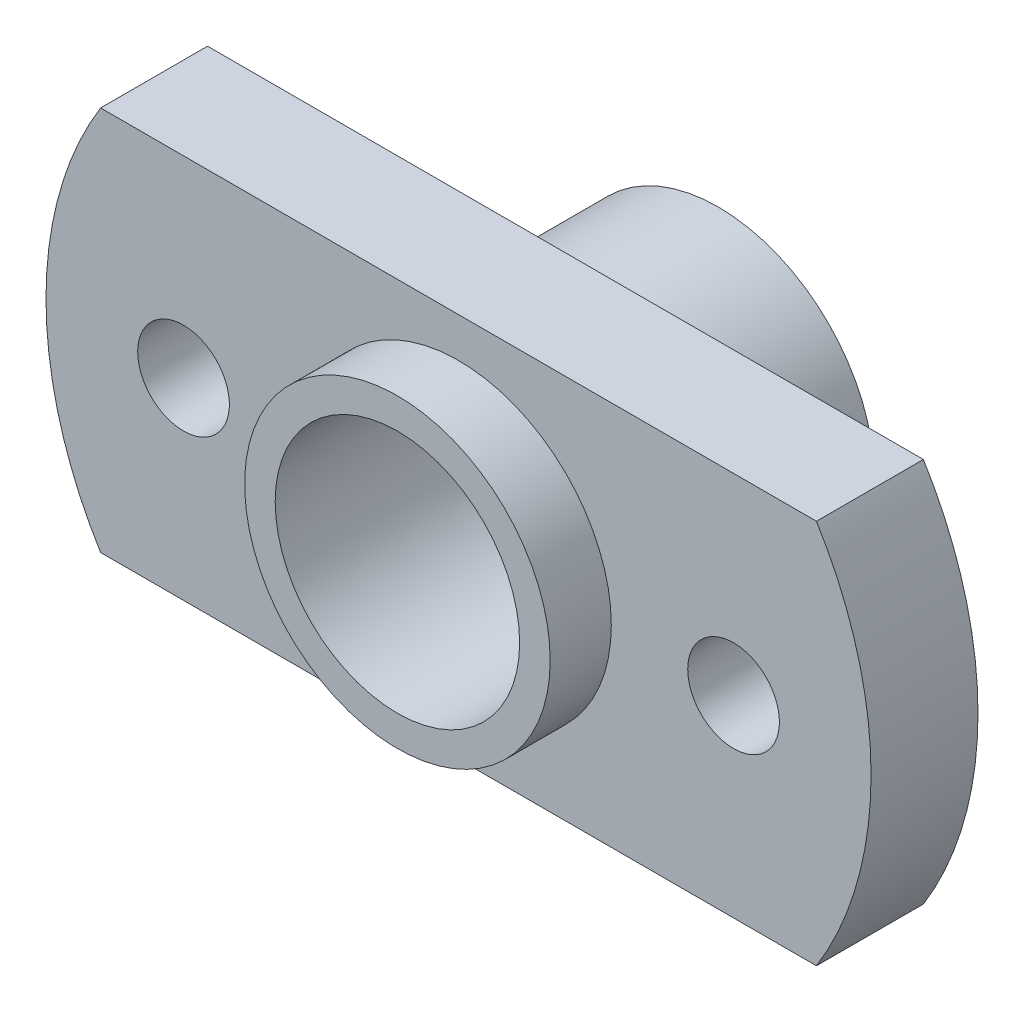
ISO-10303-21;
HEADER;
FILE_DESCRIPTION(('STEP AP214'),'2;1');
FILE_NAME('part.step','',(''),(''),'','','');
FILE_SCHEMA(('AUTOMOTIVE_DESIGN { 1 0 10303 214 1 1 1 1 }'));
ENDSEC;
DATA;
#1=APPLICATION_CONTEXT('core data for automotive mechanical design processes');
#2=APPLICATION_PROTOCOL_DEFINITION('international standard','automotive_design',2000,#1);
#3=PRODUCT_CONTEXT('',#1,'mechanical');
#4=PRODUCT('Part','Part','',(#3));
#5=PRODUCT_RELATED_PRODUCT_CATEGORY('part','',(#4));
#6=PRODUCT_DEFINITION_FORMATION('','',#4);
#7=PRODUCT_DEFINITION_CONTEXT('part definition',#1,'design');
#8=PRODUCT_DEFINITION('design','',#6,#7);
#9=PRODUCT_DEFINITION_SHAPE('','',#8);
#10=(LENGTH_UNIT() NAMED_UNIT(*) SI_UNIT(.MILLI.,.METRE.));
#11=(NAMED_UNIT(*) PLANE_ANGLE_UNIT() SI_UNIT($,.RADIAN.));
#12=(NAMED_UNIT(*) SI_UNIT($,.STERADIAN.) SOLID_ANGLE_UNIT());
#13=UNCERTAINTY_MEASURE_WITH_UNIT(LENGTH_MEASURE(1.E-05),#10,'distance_accuracy_value','');
#14=(GEOMETRIC_REPRESENTATION_CONTEXT(3) GLOBAL_UNCERTAINTY_ASSIGNED_CONTEXT((#13)) GLOBAL_UNIT_ASSIGNED_CONTEXT((#10,
#11,#12)) REPRESENTATION_CONTEXT('',''));
#15=CARTESIAN_POINT('',(0.,0.,0.));
#16=DIRECTION('',(0.,0.,1.));
#17=DIRECTION('',(1.,0.,0.));
#18=AXIS2_PLACEMENT_3D('',#15,#16,#17);
#19=CARTESIAN_POINT('',(-166.1,-80.50005788601,172.0264319846));
#20=DIRECTION('',(0.,0.,1.));
#21=DIRECTION('',(1.,0.,0.));
#22=AXIS2_PLACEMENT_3D('',#19,#20,#21);
#23=PLANE('',#22);
#24=CARTESIAN_POINT('',(-166.1,-80.50005788601,172.0264319846));
#25=DIRECTION('',(0.,0.,-1.));
#26=DIRECTION('',(-1.,0.,0.));
#27=AXIS2_PLACEMENT_3D('',#24,#25,#26);
#28=CIRCLE('',#27,4.);
#29=CARTESIAN_POINT('',(-170.1,-80.50005788601,172.0264319846));
#30=VERTEX_POINT('',#29);
#31=EDGE_CURVE('E111',#30,#30,#28,.F.);
#32=ORIENTED_EDGE('',*,*,#31,.T.);
#33=EDGE_LOOP('',(#32));
#34=FACE_BOUND('',#33,.T.);
#35=CARTESIAN_POINT('',(-166.1,-80.50005788601,172.0264319846));
#36=DIRECTION('',(0.,0.,-1.));
#37=DIRECTION('',(-1.,0.,0.));
#38=AXIS2_PLACEMENT_3D('',#35,#36,#37);
#39=CIRCLE('',#38,5.09999999999999);
#40=CARTESIAN_POINT('',(-171.2,-80.50005788601,172.0264319846));
#41=VERTEX_POINT('',#40);
#42=EDGE_CURVE('E19',#41,#41,#39,.F.);
#43=ORIENTED_EDGE('',*,*,#42,.F.);
#44=EDGE_LOOP('',(#43));
#45=FACE_BOUND('',#44,.T.);
#46=ADVANCED_FACE('F16',(#34,#45),#23,.F.);
#47=CARTESIAN_POINT('',(-166.1,-80.50005788601,182.5264319846));
#48=DIRECTION('',(0.,0.,-1.));
#49=DIRECTION('',(-1.,0.,0.));
#50=AXIS2_PLACEMENT_3D('',#47,#48,#49);
#51=CYLINDRICAL_SURFACE('',#50,5.09999999999999);
#52=ORIENTED_EDGE('',*,*,#42,.T.);
#53=EDGE_LOOP('',(#52));
#54=FACE_BOUND('',#53,.T.);
#55=CARTESIAN_POINT('',(-166.1,-80.50005788601,177.0264319846));
#56=DIRECTION('',(0.,0.,-1.));
#57=DIRECTION('',(-1.,0.,0.));
#58=AXIS2_PLACEMENT_3D('',#55,#56,#57);
#59=CIRCLE('',#58,5.09999999999999);
#60=CARTESIAN_POINT('',(-171.2,-80.50005788601,177.0264319846));
#61=VERTEX_POINT('',#60);
#62=EDGE_CURVE('E109',#61,#61,#59,.T.);
#63=ORIENTED_EDGE('',*,*,#62,.T.);
#64=EDGE_LOOP('',(#63));
#65=FACE_BOUND('',#64,.T.);
#66=ADVANCED_FACE('F118',(#54,#65),#51,.T.);
#67=CARTESIAN_POINT('',(-166.1,-80.50005788601,182.5264319846));
#68=DIRECTION('',(0.,0.,-1.));
#69=DIRECTION('',(-1.,0.,0.));
#70=AXIS2_PLACEMENT_3D('',#67,#68,#69);
#71=CYLINDRICAL_SURFACE('',#70,4.);
#72=CARTESIAN_POINT('',(-166.1,-80.50005788601,182.5264319846));
#73=DIRECTION('',(0.,0.,-1.));
#74=DIRECTION('',(-1.,0.,0.));
#75=AXIS2_PLACEMENT_3D('',#72,#73,#74);
#76=CIRCLE('',#75,4.);
#77=CARTESIAN_POINT('',(-170.1,-80.50005788601,182.5264319846));
#78=VERTEX_POINT('',#77);
#79=EDGE_CURVE('E106',#78,#78,#76,.T.);
#80=ORIENTED_EDGE('',*,*,#79,.F.);
#81=EDGE_LOOP('',(#80));
#82=FACE_BOUND('',#81,.T.);
#83=ORIENTED_EDGE('',*,*,#31,.F.);
#84=EDGE_LOOP('',(#83));
#85=FACE_BOUND('',#84,.T.);
#86=ADVANCED_FACE('F126',(#82,#85),#71,.F.);
#87=CARTESIAN_POINT('',(-166.1,-80.50005788601,177.0264319846));
#88=DIRECTION('',(0.,0.,1.));
#89=DIRECTION('',(1.,0.,0.));
#90=AXIS2_PLACEMENT_3D('',#87,#88,#89);
#91=PLANE('',#90);
#92=ORIENTED_EDGE('',*,*,#62,.F.);
#93=EDGE_LOOP('',(#92));
#94=FACE_BOUND('',#93,.T.);
#95=DIRECTION('',(1.,0.,0.));
#96=VECTOR('',#95,1.);
#97=CARTESIAN_POINT('',(-155.8528172695,-74.20005788601,177.0264319846));
#98=LINE('',#97,#96);
#99=CARTESIAN_POINT('',(-177.813226718326,-74.20005788601,177.0264319846));
#100=VERTEX_POINT('',#99);
#101=CARTESIAN_POINT('',(-154.386773281667,-74.20005788601,177.0264319846));
#102=VERTEX_POINT('',#101);
#103=EDGE_CURVE('E60',#100,#102,#98,.T.);
#104=ORIENTED_EDGE('',*,*,#103,.T.);
#105=CARTESIAN_POINT('',(-164.6,-80.50005788601,177.0264319846));
#106=DIRECTION('',(0.,0.,1.));
#107=DIRECTION('',(1.,0.,0.));
#108=AXIS2_PLACEMENT_3D('',#105,#106,#107);
#109=CIRCLE('',#108,12.);
#110=CARTESIAN_POINT('',(-154.386773281659,-86.8000578859906,177.0264319846));
#111=VERTEX_POINT('',#110);
#112=EDGE_CURVE('E80',#111,#102,#109,.T.);
#113=ORIENTED_EDGE('',*,*,#112,.F.);
#114=DIRECTION('',(1.,0.,0.));
#115=VECTOR('',#114,1.);
#116=CARTESIAN_POINT('',(-177.6681148043,-86.80005788601,177.0264319846));
#117=LINE('',#116,#115);
#118=CARTESIAN_POINT('',(-177.813226718329,-86.80005788601,177.0264319846));
#119=VERTEX_POINT('',#118);
#120=EDGE_CURVE('E63',#111,#119,#117,.F.);
#121=ORIENTED_EDGE('',*,*,#120,.T.);
#122=CARTESIAN_POINT('',(-167.6,-80.50005788601,177.0264319846));
#123=DIRECTION('',(0.,0.,1.));
#124=DIRECTION('',(1.,0.,0.));
#125=AXIS2_PLACEMENT_3D('',#122,#123,#124);
#126=CIRCLE('',#125,12.);
#127=EDGE_CURVE('E55',#100,#119,#126,.T.);
#128=ORIENTED_EDGE('',*,*,#127,.F.);
#129=EDGE_LOOP('',(#104,#113,#121,#128));
#130=FACE_BOUND('',#129,.T.);
#131=CARTESIAN_POINT('',(-175.1,-80.50005788601,177.0264319846));
#132=DIRECTION('',(0.,0.,-1.));
#133=DIRECTION('',(-1.,0.,0.));
#134=AXIS2_PLACEMENT_3D('',#131,#132,#133);
#135=CIRCLE('',#134,1.5);
#136=CARTESIAN_POINT('',(-176.6,-80.50005788601,177.0264319846));
#137=VERTEX_POINT('',#136);
#138=EDGE_CURVE('E66',#137,#137,#135,.F.);
#139=ORIENTED_EDGE('',*,*,#138,.T.);
#140=EDGE_LOOP('',(#139));
#141=FACE_BOUND('',#140,.T.);
#142=CARTESIAN_POINT('',(-157.1,-80.50005788601,177.0264319846));
#143=DIRECTION('',(0.,0.,-1.));
#144=DIRECTION('',(-1.,0.,0.));
#145=AXIS2_PLACEMENT_3D('',#142,#143,#144);
#146=CIRCLE('',#145,1.5);
#147=CARTESIAN_POINT('',(-158.6,-80.50005788601,177.0264319846));
#148=VERTEX_POINT('',#147);
#149=EDGE_CURVE('E103',#148,#148,#146,.F.);
#150=ORIENTED_EDGE('',*,*,#149,.T.);
#151=EDGE_LOOP('',(#150));
#152=FACE_BOUND('',#151,.T.);
#153=ADVANCED_FACE('F57',(#94,#130,#141,#152),#91,.F.);
#154=CARTESIAN_POINT('',(533.2347338397,-344.6602275476,182.5264319846));
#155=DIRECTION('',(0.,0.,1.));
#156=DIRECTION('',(1.,0.,0.));
#157=AXIS2_PLACEMENT_3D('',#154,#155,#156);
#158=PLANE('',#157);
#159=ORIENTED_EDGE('',*,*,#79,.T.);
#160=EDGE_LOOP('',(#159));
#161=FACE_BOUND('',#160,.T.);
#162=CARTESIAN_POINT('',(-166.1,-80.50005788601,182.5264319846));
#163=DIRECTION('',(0.,0.,1.));
#164=DIRECTION('',(1.,0.,0.));
#165=AXIS2_PLACEMENT_3D('',#162,#163,#164);
#166=CIRCLE('',#165,5.);
#167=CARTESIAN_POINT('',(-161.1,-80.50005788601,182.5264319846));
#168=VERTEX_POINT('',#167);
#169=EDGE_CURVE('E75',#168,#168,#166,.F.);
#170=ORIENTED_EDGE('',*,*,#169,.F.);
#171=EDGE_LOOP('',(#170));
#172=FACE_BOUND('',#171,.T.);
#173=ADVANCED_FACE('F157',(#161,#172),#158,.T.);
#174=CARTESIAN_POINT('',(-157.1,-80.50005788601,180.5264319846));
#175=DIRECTION('',(0.,0.,-1.));
#176=DIRECTION('',(-1.,0.,0.));
#177=AXIS2_PLACEMENT_3D('',#174,#175,#176);
#178=CYLINDRICAL_SURFACE('',#177,1.5);
#179=ORIENTED_EDGE('',*,*,#149,.F.);
#180=EDGE_LOOP('',(#179));
#181=FACE_BOUND('',#180,.T.);
#182=CARTESIAN_POINT('',(-157.1,-80.50005788601,180.5264319846));
#183=DIRECTION('',(0.,0.,-1.));
#184=DIRECTION('',(-1.,0.,0.));
#185=AXIS2_PLACEMENT_3D('',#182,#183,#184);
#186=CIRCLE('',#185,1.5);
#187=CARTESIAN_POINT('',(-158.6,-80.50005788601,180.5264319846));
#188=VERTEX_POINT('',#187);
#189=EDGE_CURVE('E96',#188,#188,#186,.T.);
#190=ORIENTED_EDGE('',*,*,#189,.F.);
#191=EDGE_LOOP('',(#190));
#192=FACE_BOUND('',#191,.T.);
#193=ADVANCED_FACE('F153',(#181,#192),#178,.F.);
#194=CARTESIAN_POINT('',(-175.1,-80.50005788601,180.5264319846));
#195=DIRECTION('',(0.,0.,-1.));
#196=DIRECTION('',(-1.,0.,0.));
#197=AXIS2_PLACEMENT_3D('',#194,#195,#196);
#198=CYLINDRICAL_SURFACE('',#197,1.5);
#199=ORIENTED_EDGE('',*,*,#138,.F.);
#200=EDGE_LOOP('',(#199));
#201=FACE_BOUND('',#200,.T.);
#202=CARTESIAN_POINT('',(-175.1,-80.50005788601,180.5264319846));
#203=DIRECTION('',(0.,0.,-1.));
#204=DIRECTION('',(-1.,0.,0.));
#205=AXIS2_PLACEMENT_3D('',#202,#203,#204);
#206=CIRCLE('',#205,1.5);
#207=CARTESIAN_POINT('',(-176.6,-80.50005788601,180.5264319846));
#208=VERTEX_POINT('',#207);
#209=EDGE_CURVE('E93',#208,#208,#206,.T.);
#210=ORIENTED_EDGE('',*,*,#209,.F.);
#211=EDGE_LOOP('',(#210));
#212=FACE_BOUND('',#211,.T.);
#213=ADVANCED_FACE('F150',(#201,#212),#198,.F.);
#214=CARTESIAN_POINT('',(-167.6,-80.50005788601,180.5264319846));
#215=DIRECTION('',(0.,0.,1.));
#216=DIRECTION('',(1.,0.,0.));
#217=AXIS2_PLACEMENT_3D('',#214,#215,#216);
#218=CYLINDRICAL_SURFACE('',#217,12.);
#219=DIRECTION('',(0.,0.,-1.));
#220=VECTOR('',#219,1.);
#221=CARTESIAN_POINT('',(-177.813226718323,-74.20005788601,177.0264319846));
#222=LINE('',#221,#220);
#223=CARTESIAN_POINT('',(-177.813226718328,-74.200057886013,180.5264319846));
#224=VERTEX_POINT('',#223);
#225=EDGE_CURVE('E69',#224,#100,#222,.T.);
#226=ORIENTED_EDGE('',*,*,#225,.T.);
#227=ORIENTED_EDGE('',*,*,#127,.T.);
#228=DIRECTION('',(0.,0.,1.));
#229=VECTOR('',#228,1.);
#230=CARTESIAN_POINT('',(-177.813226718329,-86.80005788601,177.0264319846));
#231=LINE('',#230,#229);
#232=CARTESIAN_POINT('',(-177.813226718329,-86.80005788601,180.5264319846));
#233=VERTEX_POINT('',#232);
#234=EDGE_CURVE('E87',#119,#233,#231,.T.);
#235=ORIENTED_EDGE('',*,*,#234,.T.);
#236=CARTESIAN_POINT('',(-167.6,-80.50005788601,180.5264319846));
#237=DIRECTION('',(0.,0.,1.));
#238=DIRECTION('',(1.,0.,0.));
#239=AXIS2_PLACEMENT_3D('',#236,#237,#238);
#240=CIRCLE('',#239,12.);
#241=EDGE_CURVE('E72',#224,#233,#240,.T.);
#242=ORIENTED_EDGE('',*,*,#241,.F.);
#243=EDGE_LOOP('',(#226,#227,#235,#242));
#244=FACE_BOUND('',#243,.T.);
#245=ADVANCED_FACE('F70',(#244),#218,.T.);
#246=CARTESIAN_POINT('',(-177.6681148043,-86.80005788601,177.0264319846));
#247=DIRECTION('',(0.,1.,0.));
#248=DIRECTION('',(0.,0.,1.));
#249=AXIS2_PLACEMENT_3D('',#246,#247,#248);
#250=PLANE('',#249);
#251=ORIENTED_EDGE('',*,*,#120,.F.);
#252=DIRECTION('',(0.,0.,1.));
#253=VECTOR('',#252,1.);
#254=CARTESIAN_POINT('',(-154.386773281647,-86.8000578859713,180.5264319846));
#255=LINE('',#254,#253);
#256=CARTESIAN_POINT('',(-154.386773281659,-86.8000578859906,180.5264319846));
#257=VERTEX_POINT('',#256);
#258=EDGE_CURVE('E83',#257,#111,#255,.F.);
#259=ORIENTED_EDGE('',*,*,#258,.F.);
#260=DIRECTION('',(1.,0.,0.));
#261=VECTOR('',#260,1.);
#262=CARTESIAN_POINT('',(-166.1,-86.80005788601,180.5264319846));
#263=LINE('',#262,#261);
#264=EDGE_CURVE('E91',#233,#257,#263,.T.);
#265=ORIENTED_EDGE('',*,*,#264,.F.);
#266=ORIENTED_EDGE('',*,*,#234,.F.);
#267=EDGE_LOOP('',(#251,#259,#265,#266));
#268=FACE_BOUND('',#267,.T.);
#269=ADVANCED_FACE('F143',(#268),#250,.F.);
#270=CARTESIAN_POINT('',(-164.6,-80.50005788601,180.5264319846));
#271=DIRECTION('',(0.,0.,1.));
#272=DIRECTION('',(1.,0.,0.));
#273=AXIS2_PLACEMENT_3D('',#270,#271,#272);
#274=CYLINDRICAL_SURFACE('',#273,12.);
#275=DIRECTION('',(0.,0.,-1.));
#276=VECTOR('',#275,1.);
#277=CARTESIAN_POINT('',(-154.386773281663,-74.20005788601,177.0264319846));
#278=LINE('',#277,#276);
#279=CARTESIAN_POINT('',(-154.386773281665,-74.200057886013,180.5264319846));
#280=VERTEX_POINT('',#279);
#281=EDGE_CURVE('E76',#102,#280,#278,.F.);
#282=ORIENTED_EDGE('',*,*,#281,.T.);
#283=CARTESIAN_POINT('',(-164.6,-80.50005788601,180.5264319846));
#284=DIRECTION('',(0.,0.,1.));
#285=DIRECTION('',(1.,0.,0.));
#286=AXIS2_PLACEMENT_3D('',#283,#284,#285);
#287=CIRCLE('',#286,12.);
#288=EDGE_CURVE('E34',#257,#280,#287,.T.);
#289=ORIENTED_EDGE('',*,*,#288,.F.);
#290=ORIENTED_EDGE('',*,*,#258,.T.);
#291=ORIENTED_EDGE('',*,*,#112,.T.);
#292=EDGE_LOOP('',(#282,#289,#290,#291));
#293=FACE_BOUND('',#292,.T.);
#294=ADVANCED_FACE('F140',(#293),#274,.T.);
#295=CARTESIAN_POINT('',(-155.8528172695,-74.20005788601,177.0264319846));
#296=DIRECTION('',(0.,-1.,0.));
#297=DIRECTION('',(0.,0.,-1.));
#298=AXIS2_PLACEMENT_3D('',#295,#296,#297);
#299=PLANE('',#298);
#300=DIRECTION('',(1.,0.,0.));
#301=VECTOR('',#300,1.);
#302=CARTESIAN_POINT('',(-166.1,-74.200057886016,180.5264319846));
#303=LINE('',#302,#301);
#304=EDGE_CURVE('E25',#280,#224,#303,.F.);
#305=ORIENTED_EDGE('',*,*,#304,.F.);
#306=ORIENTED_EDGE('',*,*,#281,.F.);
#307=ORIENTED_EDGE('',*,*,#103,.F.);
#308=ORIENTED_EDGE('',*,*,#225,.F.);
#309=EDGE_LOOP('',(#305,#306,#307,#308));
#310=FACE_BOUND('',#309,.T.);
#311=ADVANCED_FACE('F79',(#310),#299,.F.);
#312=CARTESIAN_POINT('',(-166.1,-80.50005788601,180.5264319846));
#313=DIRECTION('',(0.,0.,1.));
#314=DIRECTION('',(1.,0.,0.));
#315=AXIS2_PLACEMENT_3D('',#312,#313,#314);
#316=CYLINDRICAL_SURFACE('',#315,5.);
#317=ORIENTED_EDGE('',*,*,#169,.T.);
#318=EDGE_LOOP('',(#317));
#319=FACE_BOUND('',#318,.T.);
#320=CARTESIAN_POINT('',(-166.1,-80.50005788601,180.5264319846));
#321=DIRECTION('',(0.,0.,1.));
#322=DIRECTION('',(1.,0.,0.));
#323=AXIS2_PLACEMENT_3D('',#320,#321,#322);
#324=CIRCLE('',#323,5.);
#325=CARTESIAN_POINT('',(-161.1,-80.50005788601,180.5264319846));
#326=VERTEX_POINT('',#325);
#327=EDGE_CURVE('E11',#326,#326,#324,.F.);
#328=ORIENTED_EDGE('',*,*,#327,.F.);
#329=EDGE_LOOP('',(#328));
#330=FACE_BOUND('',#329,.T.);
#331=ADVANCED_FACE('F129',(#319,#330),#316,.T.);
#332=CARTESIAN_POINT('',(-166.1,-80.50005788601,180.5264319846));
#333=DIRECTION('',(0.,0.,1.));
#334=DIRECTION('',(1.,0.,0.));
#335=AXIS2_PLACEMENT_3D('',#332,#333,#334);
#336=PLANE('',#335);
#337=ORIENTED_EDGE('',*,*,#327,.T.);
#338=EDGE_LOOP('',(#337));
#339=FACE_BOUND('',#338,.T.);
#340=ORIENTED_EDGE('',*,*,#288,.T.);
#341=ORIENTED_EDGE('',*,*,#304,.T.);
#342=ORIENTED_EDGE('',*,*,#241,.T.);
#343=ORIENTED_EDGE('',*,*,#264,.T.);
#344=EDGE_LOOP('',(#340,#341,#342,#343));
#345=FACE_BOUND('',#344,.T.);
#346=ORIENTED_EDGE('',*,*,#209,.T.);
#347=EDGE_LOOP('',(#346));
#348=FACE_BOUND('',#347,.T.);
#349=ORIENTED_EDGE('',*,*,#189,.T.);
#350=EDGE_LOOP('',(#349));
#351=FACE_BOUND('',#350,.T.);
#352=ADVANCED_FACE('F127',(#339,#345,#348,#351),#336,.T.);
#353=CLOSED_SHELL('',(#46,#66,#86,#153,#173,#193,#213,#245,#269,#294,#311,#331,#352));
#354=MANIFOLD_SOLID_BREP('B1',#353);
#355=ADVANCED_BREP_SHAPE_REPRESENTATION('',(#18,#354),#14);
#356=SHAPE_DEFINITION_REPRESENTATION(#9,#355);
ENDSEC;
END-ISO-10303-21;
